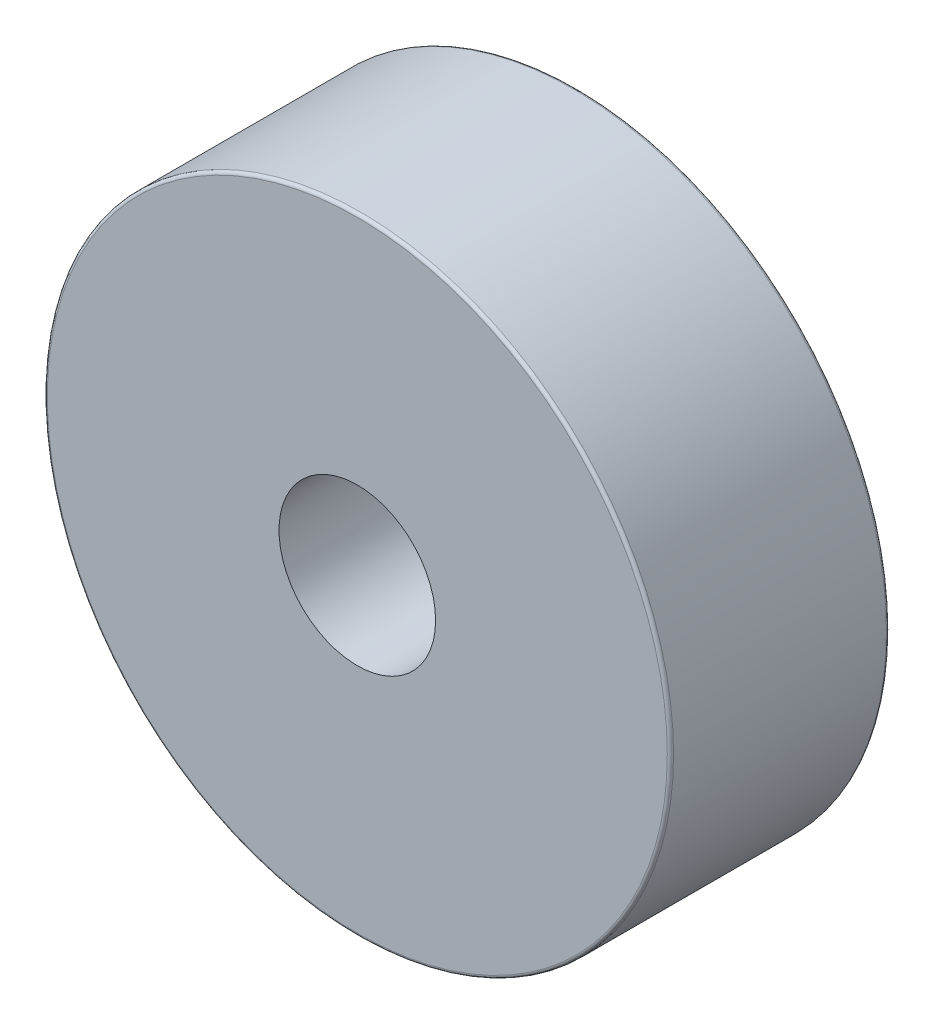
ISO-10303-21;
HEADER;
FILE_DESCRIPTION(('STEP AP214'),'2;1');
FILE_NAME('part.step','',(''),(''),'','','');
FILE_SCHEMA(('AUTOMOTIVE_DESIGN { 1 0 10303 214 1 1 1 1 }'));
ENDSEC;
DATA;
#1=APPLICATION_CONTEXT('core data for automotive mechanical design processes');
#2=APPLICATION_PROTOCOL_DEFINITION('international standard','automotive_design',2000,#1);
#3=PRODUCT_CONTEXT('',#1,'mechanical');
#4=PRODUCT('Part','Part','',(#3));
#5=PRODUCT_RELATED_PRODUCT_CATEGORY('part','',(#4));
#6=PRODUCT_DEFINITION_FORMATION('','',#4);
#7=PRODUCT_DEFINITION_CONTEXT('part definition',#1,'design');
#8=PRODUCT_DEFINITION('design','',#6,#7);
#9=PRODUCT_DEFINITION_SHAPE('','',#8);
#10=(LENGTH_UNIT() NAMED_UNIT(*) SI_UNIT(.MILLI.,.METRE.));
#11=(NAMED_UNIT(*) PLANE_ANGLE_UNIT() SI_UNIT($,.RADIAN.));
#12=(NAMED_UNIT(*) SI_UNIT($,.STERADIAN.) SOLID_ANGLE_UNIT());
#13=UNCERTAINTY_MEASURE_WITH_UNIT(LENGTH_MEASURE(1.E-05),#10,'distance_accuracy_value','');
#14=(GEOMETRIC_REPRESENTATION_CONTEXT(3) GLOBAL_UNCERTAINTY_ASSIGNED_CONTEXT((#13)) GLOBAL_UNIT_ASSIGNED_CONTEXT((#10,
#11,#12)) REPRESENTATION_CONTEXT('',''));
#15=CARTESIAN_POINT('',(0.,0.,0.));
#16=DIRECTION('',(0.,0.,1.));
#17=DIRECTION('',(1.,0.,0.));
#18=AXIS2_PLACEMENT_3D('',#15,#16,#17);
#19=CARTESIAN_POINT('',(0.,0.,7.));
#20=DIRECTION('',(0.,0.,1.));
#21=DIRECTION('',(1.,0.,0.));
#22=AXIS2_PLACEMENT_3D('',#19,#20,#21);
#23=PLANE('',#22);
#24=CARTESIAN_POINT('',(0.,0.,7.));
#25=DIRECTION('',(0.,0.,1.));
#26=DIRECTION('',(1.,0.,0.));
#27=AXIS2_PLACEMENT_3D('',#24,#25,#26);
#28=CIRCLE('',#27,9.9);
#29=CARTESIAN_POINT('',(9.9,0.,7.));
#30=VERTEX_POINT('',#29);
#31=EDGE_CURVE('E48',#30,#30,#28,.T.);
#32=ORIENTED_EDGE('',*,*,#31,.T.);
#33=EDGE_LOOP('',(#32));
#34=FACE_BOUND('',#33,.T.);
#35=CARTESIAN_POINT('',(0.,0.,7.));
#36=DIRECTION('',(0.,0.,1.));
#37=DIRECTION('',(1.,0.,0.));
#38=AXIS2_PLACEMENT_3D('',#35,#36,#37);
#39=CIRCLE('',#38,2.5);
#40=CARTESIAN_POINT('',(2.5,0.,7.));
#41=VERTEX_POINT('',#40);
#42=EDGE_CURVE('E53',#41,#41,#39,.T.);
#43=ORIENTED_EDGE('',*,*,#42,.F.);
#44=EDGE_LOOP('',(#43));
#45=FACE_BOUND('',#44,.T.);
#46=ADVANCED_FACE('F33',(#34,#45),#23,.T.);
#47=CARTESIAN_POINT('',(0.,0.,0.));
#48=DIRECTION('',(0.,0.,1.));
#49=DIRECTION('',(1.,0.,0.));
#50=AXIS2_PLACEMENT_3D('',#47,#48,#49);
#51=PLANE('',#50);
#52=CARTESIAN_POINT('',(0.,0.,0.));
#53=DIRECTION('',(0.,0.,1.));
#54=DIRECTION('',(1.,0.,0.));
#55=AXIS2_PLACEMENT_3D('',#52,#53,#54);
#56=CIRCLE('',#55,9.9);
#57=CARTESIAN_POINT('',(9.9,0.,0.));
#58=VERTEX_POINT('',#57);
#59=EDGE_CURVE('E10',#58,#58,#56,.F.);
#60=ORIENTED_EDGE('',*,*,#59,.T.);
#61=EDGE_LOOP('',(#60));
#62=FACE_BOUND('',#61,.T.);
#63=CARTESIAN_POINT('',(0.,0.,0.));
#64=DIRECTION('',(0.,0.,1.));
#65=DIRECTION('',(1.,0.,0.));
#66=AXIS2_PLACEMENT_3D('',#63,#64,#65);
#67=CIRCLE('',#66,2.5);
#68=CARTESIAN_POINT('',(2.5,0.,0.));
#69=VERTEX_POINT('',#68);
#70=EDGE_CURVE('E54',#69,#69,#67,.T.);
#71=ORIENTED_EDGE('',*,*,#70,.T.);
#72=EDGE_LOOP('',(#71));
#73=FACE_BOUND('',#72,.T.);
#74=ADVANCED_FACE('F64',(#62,#73),#51,.F.);
#75=CARTESIAN_POINT('',(0.,0.,7.));
#76=DIRECTION('',(0.,0.,-1.));
#77=DIRECTION('',(-1.,0.,0.));
#78=AXIS2_PLACEMENT_3D('',#75,#76,#77);
#79=CYLINDRICAL_SURFACE('',#78,10.);
#80=CARTESIAN_POINT('',(0.,0.,6.9));
#81=DIRECTION('',(0.,0.,1.));
#82=DIRECTION('',(1.,0.,0.));
#83=AXIS2_PLACEMENT_3D('',#80,#81,#82);
#84=CIRCLE('',#83,10.);
#85=CARTESIAN_POINT('',(10.,0.,6.9));
#86=VERTEX_POINT('',#85);
#87=EDGE_CURVE('E40',#86,#86,#84,.F.);
#88=ORIENTED_EDGE('',*,*,#87,.T.);
#89=EDGE_LOOP('',(#88));
#90=FACE_BOUND('',#89,.T.);
#91=CARTESIAN_POINT('',(0.,0.,0.1));
#92=DIRECTION('',(0.,0.,1.));
#93=DIRECTION('',(1.,0.,0.));
#94=AXIS2_PLACEMENT_3D('',#91,#92,#93);
#95=CIRCLE('',#94,10.);
#96=CARTESIAN_POINT('',(10.,0.,0.1));
#97=VERTEX_POINT('',#96);
#98=EDGE_CURVE('E44',#97,#97,#95,.T.);
#99=ORIENTED_EDGE('',*,*,#98,.T.);
#100=EDGE_LOOP('',(#99));
#101=FACE_BOUND('',#100,.T.);
#102=ADVANCED_FACE('F70',(#90,#101),#79,.T.);
#103=CARTESIAN_POINT('',(0.,0.,7.));
#104=DIRECTION('',(0.,0.,-1.));
#105=DIRECTION('',(-1.,0.,0.));
#106=AXIS2_PLACEMENT_3D('',#103,#104,#105);
#107=CYLINDRICAL_SURFACE('',#106,2.5);
#108=ORIENTED_EDGE('',*,*,#42,.T.);
#109=EDGE_LOOP('',(#108));
#110=FACE_BOUND('',#109,.T.);
#111=ORIENTED_EDGE('',*,*,#70,.F.);
#112=EDGE_LOOP('',(#111));
#113=FACE_BOUND('',#112,.T.);
#114=ADVANCED_FACE('F60',(#110,#113),#107,.F.);
#115=CARTESIAN_POINT('',(0.,0.,6.9));
#116=DIRECTION('',(0.,0.,1.));
#117=DIRECTION('',(1.,0.,0.));
#118=AXIS2_PLACEMENT_3D('',#115,#116,#117);
#119=TOROIDAL_SURFACE('',#118,9.9,0.1);
#120=ORIENTED_EDGE('',*,*,#87,.F.);
#121=EDGE_LOOP('',(#120));
#122=FACE_BOUND('',#121,.T.);
#123=ORIENTED_EDGE('',*,*,#31,.F.);
#124=EDGE_LOOP('',(#123));
#125=FACE_BOUND('',#124,.T.);
#126=ADVANCED_FACE('F75',(#122,#125),#119,.T.);
#127=CARTESIAN_POINT('',(0.,0.,0.1));
#128=DIRECTION('',(0.,0.,1.));
#129=DIRECTION('',(1.,0.,0.));
#130=AXIS2_PLACEMENT_3D('',#127,#128,#129);
#131=TOROIDAL_SURFACE('',#130,9.9,0.1);
#132=ORIENTED_EDGE('',*,*,#59,.F.);
#133=EDGE_LOOP('',(#132));
#134=FACE_BOUND('',#133,.T.);
#135=ORIENTED_EDGE('',*,*,#98,.F.);
#136=EDGE_LOOP('',(#135));
#137=FACE_BOUND('',#136,.T.);
#138=ADVANCED_FACE('F35',(#134,#137),#131,.T.);
#139=CLOSED_SHELL('',(#46,#74,#102,#114,#126,#138));
#140=MANIFOLD_SOLID_BREP('B2',#139);
#141=ADVANCED_BREP_SHAPE_REPRESENTATION('',(#18,#140),#14);
#142=SHAPE_DEFINITION_REPRESENTATION(#9,#141);
ENDSEC;
END-ISO-10303-21;
